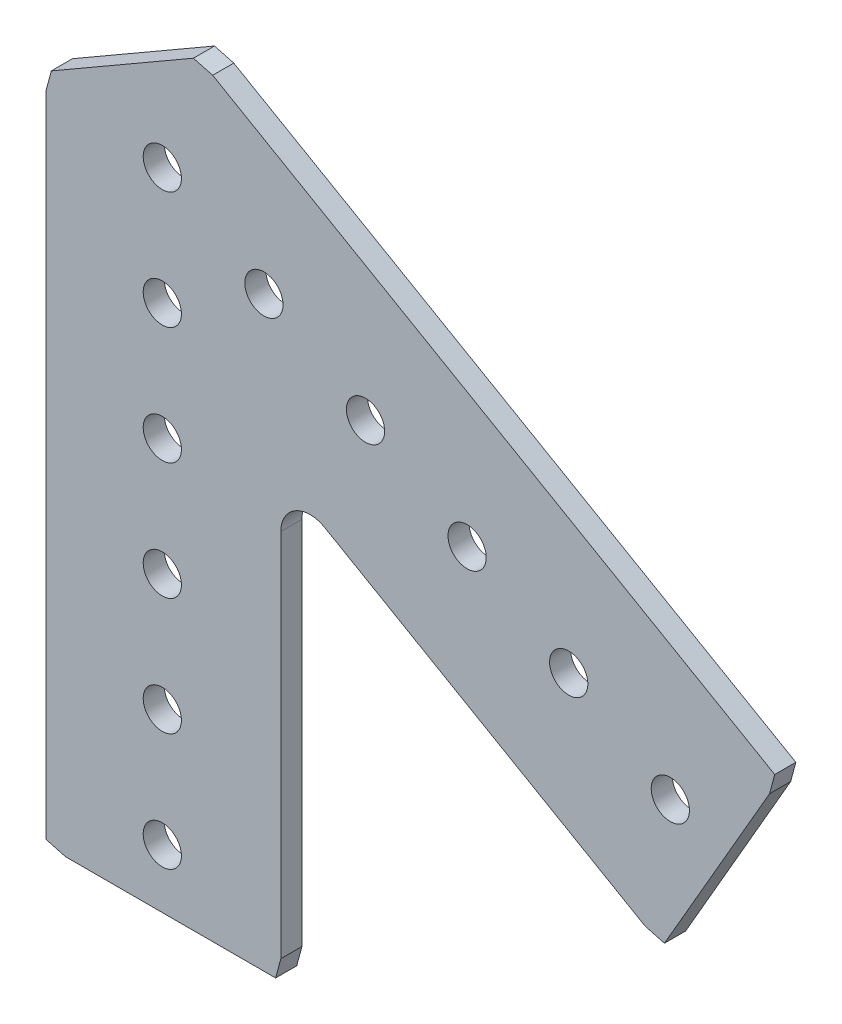
ISO-10303-21;
HEADER;
FILE_DESCRIPTION(('STEP AP214'),'2;1');
FILE_NAME('part.step','',(''),(''),'','','');
FILE_SCHEMA(('AUTOMOTIVE_DESIGN { 1 0 10303 214 1 1 1 1 }'));
ENDSEC;
DATA;
#1=APPLICATION_CONTEXT('core data for automotive mechanical design processes');
#2=APPLICATION_PROTOCOL_DEFINITION('international standard','automotive_design',2000,#1);
#3=PRODUCT_CONTEXT('',#1,'mechanical');
#4=PRODUCT('Part','Part','',(#3));
#5=PRODUCT_RELATED_PRODUCT_CATEGORY('part','',(#4));
#6=PRODUCT_DEFINITION_FORMATION('','',#4);
#7=PRODUCT_DEFINITION_CONTEXT('part definition',#1,'design');
#8=PRODUCT_DEFINITION('design','',#6,#7);
#9=PRODUCT_DEFINITION_SHAPE('','',#8);
#10=(LENGTH_UNIT() NAMED_UNIT(*) SI_UNIT(.MILLI.,.METRE.));
#11=(NAMED_UNIT(*) PLANE_ANGLE_UNIT() SI_UNIT($,.RADIAN.));
#12=(NAMED_UNIT(*) SI_UNIT($,.STERADIAN.) SOLID_ANGLE_UNIT());
#13=UNCERTAINTY_MEASURE_WITH_UNIT(LENGTH_MEASURE(1.E-05),#10,'distance_accuracy_value','');
#14=(GEOMETRIC_REPRESENTATION_CONTEXT(3) GLOBAL_UNCERTAINTY_ASSIGNED_CONTEXT((#13)) GLOBAL_UNIT_ASSIGNED_CONTEXT((#10,
#11,#12)) REPRESENTATION_CONTEXT('',''));
#15=CARTESIAN_POINT('',(0.,0.,0.));
#16=DIRECTION('',(0.,0.,1.));
#17=DIRECTION('',(1.,0.,0.));
#18=AXIS2_PLACEMENT_3D('',#15,#16,#17);
#19=CARTESIAN_POINT('',(16.002,-27.7162770227176,0.));
#20=DIRECTION('',(0.,0.,1.));
#21=DIRECTION('',(1.,0.,0.));
#22=AXIS2_PLACEMENT_3D('',#19,#20,#21);
#23=CYLINDRICAL_SURFACE('',#22,3.175);
#24=CARTESIAN_POINT('',(16.002,-27.7162770227176,2.286));
#25=DIRECTION('',(0.,0.,-1.));
#26=DIRECTION('',(-1.,0.,0.));
#27=AXIS2_PLACEMENT_3D('',#24,#25,#26);
#28=CIRCLE('',#27,3.175);
#29=CARTESIAN_POINT('',(12.827,-27.7162770227176,2.286));
#30=VERTEX_POINT('',#29);
#31=CARTESIAN_POINT('',(17.5895,-24.966646365702,2.286));
#32=VERTEX_POINT('',#31);
#33=EDGE_CURVE('E166',#30,#32,#28,.T.);
#34=ORIENTED_EDGE('',*,*,#33,.F.);
#35=DIRECTION('',(0.,0.,1.));
#36=VECTOR('',#35,1.);
#37=CARTESIAN_POINT('',(12.827,-27.7162770227176,0.));
#38=LINE('',#37,#36);
#39=CARTESIAN_POINT('',(12.827,-27.7162770227176,0.));
#40=VERTEX_POINT('',#39);
#41=EDGE_CURVE('E11',#40,#30,#38,.T.);
#42=ORIENTED_EDGE('',*,*,#41,.F.);
#43=CARTESIAN_POINT('',(16.002,-27.7162770227176,0.));
#44=DIRECTION('',(0.,0.,-1.));
#45=DIRECTION('',(-1.,0.,0.));
#46=AXIS2_PLACEMENT_3D('',#43,#44,#45);
#47=CIRCLE('',#46,3.175);
#48=CARTESIAN_POINT('',(17.5895,-24.966646365702,0.));
#49=VERTEX_POINT('',#48);
#50=EDGE_CURVE('E205',#40,#49,#47,.T.);
#51=ORIENTED_EDGE('',*,*,#50,.T.);
#52=DIRECTION('',(0.,0.,1.));
#53=VECTOR('',#52,1.);
#54=CARTESIAN_POINT('',(17.5895,-24.966646365702,0.));
#55=LINE('',#54,#53);
#56=EDGE_CURVE('E36',#49,#32,#55,.T.);
#57=ORIENTED_EDGE('',*,*,#56,.T.);
#58=EDGE_LOOP('',(#34,#42,#51,#57));
#59=FACE_BOUND('',#58,.T.);
#60=ADVANCED_FACE('F33',(#59),#23,.F.);
#61=CARTESIAN_POINT('',(12.827,-67.7645661410419,0.));
#62=DIRECTION('',(1.,0.,0.));
#63=DIRECTION('',(0.,1.,0.));
#64=AXIS2_PLACEMENT_3D('',#61,#62,#63);
#65=PLANE('',#64);
#66=DIRECTION('',(0.,1.,0.));
#67=VECTOR('',#66,1.);
#68=CARTESIAN_POINT('',(12.827,-67.7645661410419,2.286));
#69=LINE('',#68,#67);
#70=CARTESIAN_POINT('',(12.827,-67.7645661410419,2.286));
#71=VERTEX_POINT('',#70);
#72=EDGE_CURVE('E203',#71,#30,#69,.T.);
#73=ORIENTED_EDGE('',*,*,#72,.F.);
#74=DIRECTION('',(0.,0.,1.));
#75=VECTOR('',#74,1.);
#76=CARTESIAN_POINT('',(12.827,-67.7645661410419,0.));
#77=LINE('',#76,#75);
#78=CARTESIAN_POINT('',(12.827,-67.7645661410419,0.));
#79=VERTEX_POINT('',#78);
#80=EDGE_CURVE('E42',#79,#71,#77,.T.);
#81=ORIENTED_EDGE('',*,*,#80,.F.);
#82=DIRECTION('',(0.,1.,0.));
#83=VECTOR('',#82,1.);
#84=CARTESIAN_POINT('',(12.827,-67.7645661410419,0.));
#85=LINE('',#84,#83);
#86=EDGE_CURVE('E156',#79,#40,#85,.T.);
#87=ORIENTED_EDGE('',*,*,#86,.T.);
#88=ORIENTED_EDGE('',*,*,#41,.T.);
#89=EDGE_LOOP('',(#73,#81,#87,#88));
#90=FACE_BOUND('',#89,.T.);
#91=ADVANCED_FACE('F229',(#90),#65,.T.);
#92=CARTESIAN_POINT('',(12.2682096816237,-69.85,0.));
#93=DIRECTION('',(0.96592582628907,-0.258819045102513,0.));
#94=DIRECTION('',(0.258819045102513,0.96592582628907,0.));
#95=AXIS2_PLACEMENT_3D('',#92,#93,#94);
#96=PLANE('',#95);
#97=DIRECTION('',(0.258819045102513,0.96592582628907,0.));
#98=VECTOR('',#97,1.);
#99=CARTESIAN_POINT('',(12.2682096816237,-69.85,2.286));
#100=LINE('',#99,#98);
#101=CARTESIAN_POINT('',(12.2682096816237,-69.85,2.286));
#102=VERTEX_POINT('',#101);
#103=EDGE_CURVE('E143',#102,#71,#100,.T.);
#104=ORIENTED_EDGE('',*,*,#103,.F.);
#105=DIRECTION('',(0.,0.,1.));
#106=VECTOR('',#105,1.);
#107=CARTESIAN_POINT('',(12.2682096816237,-69.85,0.));
#108=LINE('',#107,#106);
#109=CARTESIAN_POINT('',(12.2682096816237,-69.85,0.));
#110=VERTEX_POINT('',#109);
#111=EDGE_CURVE('E138',#110,#102,#108,.T.);
#112=ORIENTED_EDGE('',*,*,#111,.F.);
#113=DIRECTION('',(0.258819045102513,0.96592582628907,0.));
#114=VECTOR('',#113,1.);
#115=CARTESIAN_POINT('',(12.2682096816237,-69.85,0.));
#116=LINE('',#115,#114);
#117=EDGE_CURVE('E141',#110,#79,#116,.T.);
#118=ORIENTED_EDGE('',*,*,#117,.T.);
#119=ORIENTED_EDGE('',*,*,#80,.T.);
#120=EDGE_LOOP('',(#104,#112,#118,#119));
#121=FACE_BOUND('',#120,.T.);
#122=ADVANCED_FACE('F140',(#121),#96,.T.);
#123=CARTESIAN_POINT('',(-10.4875661410418,-69.85,0.));
#124=DIRECTION('',(0.,-1.,0.));
#125=DIRECTION('',(1.,0.,0.));
#126=AXIS2_PLACEMENT_3D('',#123,#124,#125);
#127=PLANE('',#126);
#128=DIRECTION('',(1.,0.,0.));
#129=VECTOR('',#128,1.);
#130=CARTESIAN_POINT('',(-10.4875661410418,-69.85,2.286));
#131=LINE('',#130,#129);
#132=CARTESIAN_POINT('',(-10.4875661410418,-69.85,2.286));
#133=VERTEX_POINT('',#132);
#134=EDGE_CURVE('E200',#133,#102,#131,.T.);
#135=ORIENTED_EDGE('',*,*,#134,.F.);
#136=DIRECTION('',(0.,0.,1.));
#137=VECTOR('',#136,1.);
#138=CARTESIAN_POINT('',(-10.4875661410418,-69.85,0.));
#139=LINE('',#138,#137);
#140=CARTESIAN_POINT('',(-10.4875661410418,-69.85,0.));
#141=VERTEX_POINT('',#140);
#142=EDGE_CURVE('E148',#141,#133,#139,.T.);
#143=ORIENTED_EDGE('',*,*,#142,.F.);
#144=DIRECTION('',(1.,0.,0.));
#145=VECTOR('',#144,1.);
#146=CARTESIAN_POINT('',(-10.4875661410418,-69.85,0.));
#147=LINE('',#146,#145);
#148=EDGE_CURVE('E154',#141,#110,#147,.T.);
#149=ORIENTED_EDGE('',*,*,#148,.T.);
#150=ORIENTED_EDGE('',*,*,#111,.T.);
#151=EDGE_LOOP('',(#135,#143,#149,#150));
#152=FACE_BOUND('',#151,.T.);
#153=ADVANCED_FACE('F158',(#152),#127,.T.);
#154=CARTESIAN_POINT('',(-12.573,-69.2912096816237,0.));
#155=DIRECTION('',(-0.258819045102507,-0.965925826289072,0.));
#156=DIRECTION('',(0.965925826289072,-0.258819045102507,0.));
#157=AXIS2_PLACEMENT_3D('',#154,#155,#156);
#158=PLANE('',#157);
#159=DIRECTION('',(0.965925826289072,-0.258819045102507,0.));
#160=VECTOR('',#159,1.);
#161=CARTESIAN_POINT('',(-12.573,-69.2912096816237,2.286));
#162=LINE('',#161,#160);
#163=CARTESIAN_POINT('',(-12.573,-69.2912096816237,2.286));
#164=VERTEX_POINT('',#163);
#165=EDGE_CURVE('E197',#164,#133,#162,.T.);
#166=ORIENTED_EDGE('',*,*,#165,.F.);
#167=DIRECTION('',(0.,0.,1.));
#168=VECTOR('',#167,1.);
#169=CARTESIAN_POINT('',(-12.573,-69.2912096816237,0.));
#170=LINE('',#169,#168);
#171=CARTESIAN_POINT('',(-12.573,-69.2912096816237,0.));
#172=VERTEX_POINT('',#171);
#173=EDGE_CURVE('E209',#172,#164,#170,.T.);
#174=ORIENTED_EDGE('',*,*,#173,.F.);
#175=DIRECTION('',(0.965925826289072,-0.258819045102507,0.));
#176=VECTOR('',#175,1.);
#177=CARTESIAN_POINT('',(-12.573,-69.2912096816237,0.));
#178=LINE('',#177,#176);
#179=EDGE_CURVE('E159',#172,#141,#178,.T.);
#180=ORIENTED_EDGE('',*,*,#179,.T.);
#181=ORIENTED_EDGE('',*,*,#142,.T.);
#182=EDGE_LOOP('',(#166,#174,#180,#181));
#183=FACE_BOUND('',#182,.T.);
#184=ADVANCED_FACE('F242',(#183),#158,.T.);
#185=CARTESIAN_POINT('',(-12.573,0.964258685340516,0.));
#186=DIRECTION('',(-1.,0.,0.));
#187=DIRECTION('',(0.,-1.,0.));
#188=AXIS2_PLACEMENT_3D('',#185,#186,#187);
#189=PLANE('',#188);
#190=DIRECTION('',(0.,-1.,0.));
#191=VECTOR('',#190,1.);
#192=CARTESIAN_POINT('',(-12.573,0.964258685340516,2.286));
#193=LINE('',#192,#191);
#194=CARTESIAN_POINT('',(-12.573,0.964258685340516,2.286));
#195=VERTEX_POINT('',#194);
#196=EDGE_CURVE('E194',#195,#164,#193,.T.);
#197=ORIENTED_EDGE('',*,*,#196,.F.);
#198=DIRECTION('',(0.,0.,1.));
#199=VECTOR('',#198,1.);
#200=CARTESIAN_POINT('',(-12.573,0.964258685340516,0.));
#201=LINE('',#200,#199);
#202=CARTESIAN_POINT('',(-12.573,0.964258685340516,0.));
#203=VERTEX_POINT('',#202);
#204=EDGE_CURVE('E211',#203,#195,#201,.T.);
#205=ORIENTED_EDGE('',*,*,#204,.F.);
#206=DIRECTION('',(0.,-1.,0.));
#207=VECTOR('',#206,1.);
#208=CARTESIAN_POINT('',(-12.573,0.964258685340516,0.));
#209=LINE('',#208,#207);
#210=EDGE_CURVE('E161',#203,#172,#209,.T.);
#211=ORIENTED_EDGE('',*,*,#210,.T.);
#212=ORIENTED_EDGE('',*,*,#173,.T.);
#213=EDGE_LOOP('',(#197,#205,#211,#212));
#214=FACE_BOUND('',#213,.T.);
#215=ADVANCED_FACE('F245',(#214),#189,.T.);
#216=CARTESIAN_POINT('',(-12.0142096816237,3.04969254429867,0.));
#217=DIRECTION('',(-0.96592582628907,0.258819045102514,0.));
#218=DIRECTION('',(-0.258819045102514,-0.96592582628907,0.));
#219=AXIS2_PLACEMENT_3D('',#216,#217,#218);
#220=PLANE('',#219);
#221=DIRECTION('',(-0.258819045102514,-0.96592582628907,0.));
#222=VECTOR('',#221,1.);
#223=CARTESIAN_POINT('',(-12.0142096816237,3.04969254429867,2.286));
#224=LINE('',#223,#222);
#225=CARTESIAN_POINT('',(-12.0142096816237,3.04969254429867,2.286));
#226=VERTEX_POINT('',#225);
#227=EDGE_CURVE('E191',#226,#195,#224,.T.);
#228=ORIENTED_EDGE('',*,*,#227,.F.);
#229=DIRECTION('',(0.,0.,1.));
#230=VECTOR('',#229,1.);
#231=CARTESIAN_POINT('',(-12.0142096816237,3.04969254429867,0.));
#232=LINE('',#231,#230);
#233=CARTESIAN_POINT('',(-12.0142096816237,3.04969254429867,0.));
#234=VERTEX_POINT('',#233);
#235=EDGE_CURVE('E213',#234,#226,#232,.T.);
#236=ORIENTED_EDGE('',*,*,#235,.F.);
#237=DIRECTION('',(-0.258819045102514,-0.96592582628907,0.));
#238=VECTOR('',#237,1.);
#239=CARTESIAN_POINT('',(-12.0142096816237,3.04969254429867,0.));
#240=LINE('',#239,#238);
#241=EDGE_CURVE('E423',#234,#203,#240,.T.);
#242=ORIENTED_EDGE('',*,*,#241,.T.);
#243=ORIENTED_EDGE('',*,*,#204,.T.);
#244=EDGE_LOOP('',(#228,#236,#242,#243));
#245=FACE_BOUND('',#244,.T.);
#246=ADVANCED_FACE('F249',(#245),#220,.T.);
#247=CARTESIAN_POINT('',(3.36599362371686,11.9294570628281,0.));
#248=DIRECTION('',(-0.499999999999998,0.86602540378444,0.));
#249=DIRECTION('',(-0.86602540378444,-0.499999999999998,0.));
#250=AXIS2_PLACEMENT_3D('',#247,#248,#249);
#251=PLANE('',#250);
#252=DIRECTION('',(-0.86602540378444,-0.499999999999998,0.));
#253=VECTOR('',#252,1.);
#254=CARTESIAN_POINT('',(3.36599362371686,11.9294570628281,2.286));
#255=LINE('',#254,#253);
#256=CARTESIAN_POINT('',(3.36599362371686,11.9294570628281,2.286));
#257=VERTEX_POINT('',#256);
#258=EDGE_CURVE('E188',#257,#226,#255,.T.);
#259=ORIENTED_EDGE('',*,*,#258,.F.);
#260=DIRECTION('',(0.,0.,1.));
#261=VECTOR('',#260,1.);
#262=CARTESIAN_POINT('',(3.36599362371686,11.9294570628281,0.));
#263=LINE('',#262,#261);
#264=CARTESIAN_POINT('',(3.36599362371686,11.9294570628281,0.));
#265=VERTEX_POINT('',#264);
#266=EDGE_CURVE('E215',#265,#257,#263,.T.);
#267=ORIENTED_EDGE('',*,*,#266,.F.);
#268=DIRECTION('',(-0.86602540378444,-0.499999999999998,0.));
#269=VECTOR('',#268,1.);
#270=CARTESIAN_POINT('',(3.36599362371686,11.9294570628281,0.));
#271=LINE('',#270,#269);
#272=EDGE_CURVE('E420',#265,#234,#271,.T.);
#273=ORIENTED_EDGE('',*,*,#272,.T.);
#274=ORIENTED_EDGE('',*,*,#235,.T.);
#275=EDGE_LOOP('',(#259,#267,#273,#274));
#276=FACE_BOUND('',#275,.T.);
#277=ADVANCED_FACE('F253',(#276),#251,.T.);
#278=CARTESIAN_POINT('',(5.45142748267629,11.3706667444515,0.));
#279=DIRECTION('',(0.258819045102516,0.965925826289069,0.));
#280=DIRECTION('',(-0.96592582628907,0.258819045102516,0.));
#281=AXIS2_PLACEMENT_3D('',#278,#279,#280);
#282=PLANE('',#281);
#283=DIRECTION('',(-0.965925826289069,0.258819045102516,0.));
#284=VECTOR('',#283,1.);
#285=CARTESIAN_POINT('',(5.45142748267629,11.3706667444515,2.286));
#286=LINE('',#285,#284);
#287=CARTESIAN_POINT('',(5.45142748267629,11.3706667444515,2.286));
#288=VERTEX_POINT('',#287);
#289=EDGE_CURVE('E185',#288,#257,#286,.T.);
#290=ORIENTED_EDGE('',*,*,#289,.F.);
#291=DIRECTION('',(0.,0.,1.));
#292=VECTOR('',#291,1.);
#293=CARTESIAN_POINT('',(5.45142748267629,11.3706667444515,0.));
#294=LINE('',#293,#292);
#295=CARTESIAN_POINT('',(5.45142748267629,11.3706667444515,0.));
#296=VERTEX_POINT('',#295);
#297=EDGE_CURVE('E217',#296,#288,#294,.T.);
#298=ORIENTED_EDGE('',*,*,#297,.F.);
#299=DIRECTION('',(-0.965925826289069,0.258819045102516,0.));
#300=VECTOR('',#299,1.);
#301=CARTESIAN_POINT('',(5.45142748267629,11.3706667444515,0.));
#302=LINE('',#301,#300);
#303=EDGE_CURVE('E417',#296,#265,#302,.T.);
#304=ORIENTED_EDGE('',*,*,#303,.T.);
#305=ORIENTED_EDGE('',*,*,#266,.T.);
#306=EDGE_LOOP('',(#290,#298,#304,#305));
#307=FACE_BOUND('',#306,.T.);
#308=ADVANCED_FACE('F257',(#307),#282,.T.);
#309=CARTESIAN_POINT('',(66.2944478432401,-23.7570674390303,0.));
#310=DIRECTION('',(0.500000000000004,0.866025403784436,0.));
#311=DIRECTION('',(-0.866025403784436,0.500000000000004,0.));
#312=AXIS2_PLACEMENT_3D('',#309,#310,#311);
#313=PLANE('',#312);
#314=DIRECTION('',(-0.866025403784436,0.500000000000004,0.));
#315=VECTOR('',#314,1.);
#316=CARTESIAN_POINT('',(66.2944478432401,-23.7570674390303,2.286));
#317=LINE('',#316,#315);
#318=CARTESIAN_POINT('',(66.2944478432401,-23.7570674390303,2.286));
#319=VERTEX_POINT('',#318);
#320=EDGE_CURVE('E182',#319,#288,#317,.T.);
#321=ORIENTED_EDGE('',*,*,#320,.F.);
#322=DIRECTION('',(0.,0.,1.));
#323=VECTOR('',#322,1.);
#324=CARTESIAN_POINT('',(66.2944478432401,-23.7570674390303,0.));
#325=LINE('',#324,#323);
#326=CARTESIAN_POINT('',(66.2944478432401,-23.7570674390303,0.));
#327=VERTEX_POINT('',#326);
#328=EDGE_CURVE('E219',#327,#319,#325,.T.);
#329=ORIENTED_EDGE('',*,*,#328,.F.);
#330=DIRECTION('',(-0.866025403784436,0.500000000000004,0.));
#331=VECTOR('',#330,1.);
#332=CARTESIAN_POINT('',(66.2944478432401,-23.7570674390303,0.));
#333=LINE('',#332,#331);
#334=EDGE_CURVE('E414',#327,#296,#333,.T.);
#335=ORIENTED_EDGE('',*,*,#334,.T.);
#336=ORIENTED_EDGE('',*,*,#297,.T.);
#337=EDGE_LOOP('',(#321,#329,#335,#336));
#338=FACE_BOUND('',#337,.T.);
#339=ADVANCED_FACE('F261',(#338),#313,.T.);
#340=CARTESIAN_POINT('',(65.7356575248637,-25.8425012979888,0.));
#341=DIRECTION('',(0.965925826289071,-0.258819045102511,0.));
#342=DIRECTION('',(0.258819045102511,0.965925826289071,0.));
#343=AXIS2_PLACEMENT_3D('',#340,#341,#342);
#344=PLANE('',#343);
#345=DIRECTION('',(0.258819045102511,0.965925826289071,0.));
#346=VECTOR('',#345,1.);
#347=CARTESIAN_POINT('',(65.7356575248637,-25.8425012979888,2.286));
#348=LINE('',#347,#346);
#349=CARTESIAN_POINT('',(65.7356575248637,-25.8425012979888,2.286));
#350=VERTEX_POINT('',#349);
#351=EDGE_CURVE('E179',#350,#319,#348,.T.);
#352=ORIENTED_EDGE('',*,*,#351,.F.);
#353=DIRECTION('',(0.,0.,1.));
#354=VECTOR('',#353,1.);
#355=CARTESIAN_POINT('',(65.7356575248637,-25.8425012979888,0.));
#356=LINE('',#355,#354);
#357=CARTESIAN_POINT('',(65.7356575248637,-25.8425012979888,0.));
#358=VERTEX_POINT('',#357);
#359=EDGE_CURVE('E221',#358,#350,#356,.T.);
#360=ORIENTED_EDGE('',*,*,#359,.F.);
#361=DIRECTION('',(0.258819045102511,0.965925826289071,0.));
#362=VECTOR('',#361,1.);
#363=CARTESIAN_POINT('',(65.7356575248637,-25.8425012979888,0.));
#364=LINE('',#363,#362);
#365=EDGE_CURVE('E411',#358,#327,#364,.T.);
#366=ORIENTED_EDGE('',*,*,#365,.T.);
#367=ORIENTED_EDGE('',*,*,#328,.T.);
#368=EDGE_LOOP('',(#352,#360,#366,#367));
#369=FACE_BOUND('',#368,.T.);
#370=ADVANCED_FACE('F265',(#369),#344,.T.);
#371=CARTESIAN_POINT('',(54.357769613531,-45.5495812432405,0.));
#372=DIRECTION('',(0.866025403784436,-0.500000000000004,0.));
#373=DIRECTION('',(0.500000000000004,0.866025403784436,0.));
#374=AXIS2_PLACEMENT_3D('',#371,#372,#373);
#375=PLANE('',#374);
#376=DIRECTION('',(0.500000000000004,0.866025403784436,0.));
#377=VECTOR('',#376,1.);
#378=CARTESIAN_POINT('',(54.357769613531,-45.5495812432405,2.286));
#379=LINE('',#378,#377);
#380=CARTESIAN_POINT('',(54.357769613531,-45.5495812432405,2.286));
#381=VERTEX_POINT('',#380);
#382=EDGE_CURVE('E176',#381,#350,#379,.T.);
#383=ORIENTED_EDGE('',*,*,#382,.F.);
#384=DIRECTION('',(0.,0.,1.));
#385=VECTOR('',#384,1.);
#386=CARTESIAN_POINT('',(54.357769613531,-45.5495812432405,0.));
#387=LINE('',#386,#385);
#388=CARTESIAN_POINT('',(54.357769613531,-45.5495812432405,0.));
#389=VERTEX_POINT('',#388);
#390=EDGE_CURVE('E223',#389,#381,#387,.T.);
#391=ORIENTED_EDGE('',*,*,#390,.F.);
#392=DIRECTION('',(0.500000000000004,0.866025403784436,0.));
#393=VECTOR('',#392,1.);
#394=CARTESIAN_POINT('',(54.357769613531,-45.5495812432405,0.));
#395=LINE('',#394,#393);
#396=EDGE_CURVE('E408',#389,#358,#395,.T.);
#397=ORIENTED_EDGE('',*,*,#396,.T.);
#398=ORIENTED_EDGE('',*,*,#359,.T.);
#399=EDGE_LOOP('',(#383,#391,#397,#398));
#400=FACE_BOUND('',#399,.T.);
#401=ADVANCED_FACE('F269',(#400),#375,.T.);
#402=CARTESIAN_POINT('',(52.2723357545729,-44.9907909248642,0.));
#403=DIRECTION('',(-0.258819045102518,-0.965925826289069,0.));
#404=DIRECTION('',(0.965925826289069,-0.258819045102518,0.));
#405=AXIS2_PLACEMENT_3D('',#402,#403,#404);
#406=PLANE('',#405);
#407=DIRECTION('',(0.965925826289069,-0.258819045102518,0.));
#408=VECTOR('',#407,1.);
#409=CARTESIAN_POINT('',(52.2723357545729,-44.9907909248642,2.286));
#410=LINE('',#409,#408);
#411=CARTESIAN_POINT('',(52.2723357545729,-44.9907909248642,2.286));
#412=VERTEX_POINT('',#411);
#413=EDGE_CURVE('E173',#412,#381,#410,.T.);
#414=ORIENTED_EDGE('',*,*,#413,.F.);
#415=DIRECTION('',(0.,0.,1.));
#416=VECTOR('',#415,1.);
#417=CARTESIAN_POINT('',(52.2723357545729,-44.9907909248642,0.));
#418=LINE('',#417,#416);
#419=CARTESIAN_POINT('',(52.2723357545729,-44.9907909248642,0.));
#420=VERTEX_POINT('',#419);
#421=EDGE_CURVE('E224',#420,#412,#418,.T.);
#422=ORIENTED_EDGE('',*,*,#421,.F.);
#423=DIRECTION('',(0.965925826289069,-0.258819045102518,0.));
#424=VECTOR('',#423,1.);
#425=CARTESIAN_POINT('',(52.2723357545729,-44.9907909248642,0.));
#426=LINE('',#425,#424);
#427=EDGE_CURVE('E405',#420,#389,#426,.T.);
#428=ORIENTED_EDGE('',*,*,#427,.T.);
#429=ORIENTED_EDGE('',*,*,#390,.T.);
#430=EDGE_LOOP('',(#414,#422,#428,#429));
#431=FACE_BOUND('',#430,.T.);
#432=ADVANCED_FACE('F273',(#431),#406,.T.);
#433=CARTESIAN_POINT('',(17.5895,-24.966646365702,0.));
#434=DIRECTION('',(-0.5,-0.866025403784439,0.));
#435=DIRECTION('',(0.866025403784439,-0.5,0.));
#436=AXIS2_PLACEMENT_3D('',#433,#434,#435);
#437=PLANE('',#436);
#438=DIRECTION('',(0.866025403784439,-0.5,0.));
#439=VECTOR('',#438,1.);
#440=CARTESIAN_POINT('',(17.5895,-24.966646365702,2.286));
#441=LINE('',#440,#439);
#442=EDGE_CURVE('E169',#32,#412,#441,.T.);
#443=ORIENTED_EDGE('',*,*,#442,.F.);
#444=ORIENTED_EDGE('',*,*,#56,.F.);
#445=DIRECTION('',(0.866025403784439,-0.5,0.));
#446=VECTOR('',#445,1.);
#447=CARTESIAN_POINT('',(17.5895,-24.966646365702,0.));
#448=LINE('',#447,#446);
#449=EDGE_CURVE('E403',#49,#420,#448,.T.);
#450=ORIENTED_EDGE('',*,*,#449,.T.);
#451=ORIENTED_EDGE('',*,*,#421,.T.);
#452=EDGE_LOOP('',(#443,#444,#450,#451));
#453=FACE_BOUND('',#452,.T.);
#454=ADVANCED_FACE('F226',(#453),#437,.T.);
#455=CARTESIAN_POINT('',(16.002,-27.7162770227176,0.));
#456=DIRECTION('',(0.,0.,-1.));
#457=DIRECTION('',(-1.,0.,0.));
#458=AXIS2_PLACEMENT_3D('',#455,#456,#457);
#459=PLANE('',#458);
#460=CARTESIAN_POINT('',(0.,-63.5,0.));
#461=DIRECTION('',(0.,0.,1.));
#462=DIRECTION('',(-1.,0.,0.));
#463=AXIS2_PLACEMENT_3D('',#460,#461,#462);
#464=CIRCLE('',#463,2.0701);
#465=CARTESIAN_POINT('',(-2.07009999999999,-63.5,0.));
#466=VERTEX_POINT('',#465);
#467=EDGE_CURVE('E336',#466,#466,#464,.T.);
#468=ORIENTED_EDGE('',*,*,#467,.T.);
#469=EDGE_LOOP('',(#468));
#470=FACE_BOUND('',#469,.T.);
#471=CARTESIAN_POINT('',(43.9940905122498,-25.3999999999994,0.));
#472=DIRECTION('',(0.,0.,1.));
#473=DIRECTION('',(-1.,0.,0.));
#474=AXIS2_PLACEMENT_3D('',#471,#472,#473);
#475=CIRCLE('',#474,2.0701);
#476=CARTESIAN_POINT('',(41.9239905122498,-25.3999999999994,0.));
#477=VERTEX_POINT('',#476);
#478=EDGE_CURVE('E344',#477,#477,#475,.T.);
#479=ORIENTED_EDGE('',*,*,#478,.T.);
#480=EDGE_LOOP('',(#479));
#481=FACE_BOUND('',#480,.T.);
#482=CARTESIAN_POINT('',(21.9970452561249,-12.6999999999997,0.));
#483=DIRECTION('',(0.,0.,1.));
#484=DIRECTION('',(-1.,0.,0.));
#485=AXIS2_PLACEMENT_3D('',#482,#483,#484);
#486=CIRCLE('',#485,2.0701);
#487=CARTESIAN_POINT('',(19.9269452561249,-12.6999999999997,0.));
#488=VERTEX_POINT('',#487);
#489=EDGE_CURVE('E350',#488,#488,#486,.T.);
#490=ORIENTED_EDGE('',*,*,#489,.T.);
#491=EDGE_LOOP('',(#490));
#492=FACE_BOUND('',#491,.T.);
#493=CARTESIAN_POINT('',(3.9907631702977E-13,-38.1,0.));
#494=DIRECTION('',(0.,0.,1.));
#495=DIRECTION('',(-1.,0.,0.));
#496=AXIS2_PLACEMENT_3D('',#493,#494,#495);
#497=CIRCLE('',#496,2.0701);
#498=CARTESIAN_POINT('',(-2.0700999999996,-38.1,0.));
#499=VERTEX_POINT('',#498);
#500=EDGE_CURVE('E356',#499,#499,#497,.T.);
#501=ORIENTED_EDGE('',*,*,#500,.T.);
#502=EDGE_LOOP('',(#501));
#503=FACE_BOUND('',#502,.T.);
#504=CARTESIAN_POINT('',(1.33025439009923E-13,-12.7,0.));
#505=DIRECTION('',(0.,0.,1.));
#506=DIRECTION('',(-1.,0.,0.));
#507=AXIS2_PLACEMENT_3D('',#504,#505,#506);
#508=CIRCLE('',#507,2.0701);
#509=CARTESIAN_POINT('',(-2.07009999999987,-12.7,0.));
#510=VERTEX_POINT('',#509);
#511=EDGE_CURVE('E362',#510,#510,#508,.T.);
#512=ORIENTED_EDGE('',*,*,#511,.T.);
#513=EDGE_LOOP('',(#512));
#514=FACE_BOUND('',#513,.T.);
#515=CARTESIAN_POINT('',(0.,0.,0.));
#516=DIRECTION('',(0.,0.,1.));
#517=DIRECTION('',(-1.,0.,0.));
#518=AXIS2_PLACEMENT_3D('',#515,#516,#517);
#519=CIRCLE('',#518,2.0701);
#520=CARTESIAN_POINT('',(-2.0701,0.,0.));
#521=VERTEX_POINT('',#520);
#522=EDGE_CURVE('E368',#521,#521,#519,.T.);
#523=ORIENTED_EDGE('',*,*,#522,.T.);
#524=EDGE_LOOP('',(#523));
#525=FACE_BOUND('',#524,.T.);
#526=CARTESIAN_POINT('',(10.9985226280625,-6.34999999999986,0.));
#527=DIRECTION('',(0.,0.,1.));
#528=DIRECTION('',(-1.,0.,0.));
#529=AXIS2_PLACEMENT_3D('',#526,#527,#528);
#530=CIRCLE('',#529,2.0701);
#531=CARTESIAN_POINT('',(8.92842262806245,-6.34999999999986,0.));
#532=VERTEX_POINT('',#531);
#533=EDGE_CURVE('E374',#532,#532,#530,.T.);
#534=ORIENTED_EDGE('',*,*,#533,.T.);
#535=EDGE_LOOP('',(#534));
#536=FACE_BOUND('',#535,.T.);
#537=CARTESIAN_POINT('',(2.66050878019847E-13,-25.4,0.));
#538=DIRECTION('',(0.,0.,1.));
#539=DIRECTION('',(-1.,0.,0.));
#540=AXIS2_PLACEMENT_3D('',#537,#538,#539);
#541=CIRCLE('',#540,2.0701);
#542=CARTESIAN_POINT('',(-2.07009999999973,-25.4,0.));
#543=VERTEX_POINT('',#542);
#544=EDGE_CURVE('E380',#543,#543,#541,.T.);
#545=ORIENTED_EDGE('',*,*,#544,.T.);
#546=EDGE_LOOP('',(#545));
#547=FACE_BOUND('',#546,.T.);
#548=CARTESIAN_POINT('',(0.,-50.8,0.));
#549=DIRECTION('',(0.,0.,1.));
#550=DIRECTION('',(-1.,0.,0.));
#551=AXIS2_PLACEMENT_3D('',#548,#549,#550);
#552=CIRCLE('',#551,2.0701);
#553=CARTESIAN_POINT('',(-2.07009999999999,-50.8,0.));
#554=VERTEX_POINT('',#553);
#555=EDGE_CURVE('E386',#554,#554,#552,.T.);
#556=ORIENTED_EDGE('',*,*,#555,.T.);
#557=EDGE_LOOP('',(#556));
#558=FACE_BOUND('',#557,.T.);
#559=CARTESIAN_POINT('',(32.9955678841874,-19.0499999999996,0.));
#560=DIRECTION('',(0.,0.,1.));
#561=DIRECTION('',(-1.,0.,0.));
#562=AXIS2_PLACEMENT_3D('',#559,#560,#561);
#563=CIRCLE('',#562,2.0701);
#564=CARTESIAN_POINT('',(30.9254678841874,-19.0499999999996,0.));
#565=VERTEX_POINT('',#564);
#566=EDGE_CURVE('E392',#565,#565,#563,.T.);
#567=ORIENTED_EDGE('',*,*,#566,.T.);
#568=EDGE_LOOP('',(#567));
#569=FACE_BOUND('',#568,.T.);
#570=CARTESIAN_POINT('',(54.9926131403117,-31.7500000000003,0.));
#571=DIRECTION('',(0.,0.,1.));
#572=DIRECTION('',(-1.,0.,0.));
#573=AXIS2_PLACEMENT_3D('',#570,#571,#572);
#574=CIRCLE('',#573,2.0701);
#575=CARTESIAN_POINT('',(52.9225131403117,-31.7500000000003,0.));
#576=VERTEX_POINT('',#575);
#577=EDGE_CURVE('E170',#576,#576,#574,.T.);
#578=ORIENTED_EDGE('',*,*,#577,.T.);
#579=EDGE_LOOP('',(#578));
#580=FACE_BOUND('',#579,.T.);
#581=ORIENTED_EDGE('',*,*,#50,.F.);
#582=ORIENTED_EDGE('',*,*,#86,.F.);
#583=ORIENTED_EDGE('',*,*,#117,.F.);
#584=ORIENTED_EDGE('',*,*,#148,.F.);
#585=ORIENTED_EDGE('',*,*,#179,.F.);
#586=ORIENTED_EDGE('',*,*,#210,.F.);
#587=ORIENTED_EDGE('',*,*,#241,.F.);
#588=ORIENTED_EDGE('',*,*,#272,.F.);
#589=ORIENTED_EDGE('',*,*,#303,.F.);
#590=ORIENTED_EDGE('',*,*,#334,.F.);
#591=ORIENTED_EDGE('',*,*,#365,.F.);
#592=ORIENTED_EDGE('',*,*,#396,.F.);
#593=ORIENTED_EDGE('',*,*,#427,.F.);
#594=ORIENTED_EDGE('',*,*,#449,.F.);
#595=EDGE_LOOP('',(#581,#582,#583,#584,#585,#586,#587,#588,#589,#590,#591,#592,#593,#594));
#596=FACE_BOUND('',#595,.T.);
#597=ADVANCED_FACE('F152',(#470,#481,#492,#503,#514,#525,#536,#547,#558,#569,#580,#596),#459,.T.);
#598=CARTESIAN_POINT('',(16.002,-27.7162770227176,2.286));
#599=DIRECTION('',(0.,0.,-1.));
#600=DIRECTION('',(-1.,0.,0.));
#601=AXIS2_PLACEMENT_3D('',#598,#599,#600);
#602=PLANE('',#601);
#603=CARTESIAN_POINT('',(0.,-63.5,2.286));
#604=DIRECTION('',(0.,0.,1.));
#605=DIRECTION('',(-1.,0.,0.));
#606=AXIS2_PLACEMENT_3D('',#603,#604,#605);
#607=CIRCLE('',#606,2.0701);
#608=CARTESIAN_POINT('',(-2.07009999999999,-63.5,2.286));
#609=VERTEX_POINT('',#608);
#610=EDGE_CURVE('E339',#609,#609,#607,.T.);
#611=ORIENTED_EDGE('',*,*,#610,.F.);
#612=EDGE_LOOP('',(#611));
#613=FACE_BOUND('',#612,.T.);
#614=CARTESIAN_POINT('',(43.9940905122498,-25.3999999999994,2.286));
#615=DIRECTION('',(0.,0.,1.));
#616=DIRECTION('',(-1.,0.,0.));
#617=AXIS2_PLACEMENT_3D('',#614,#615,#616);
#618=CIRCLE('',#617,2.0701);
#619=CARTESIAN_POINT('',(41.9239905122498,-25.3999999999994,2.286));
#620=VERTEX_POINT('',#619);
#621=EDGE_CURVE('E341',#620,#620,#618,.T.);
#622=ORIENTED_EDGE('',*,*,#621,.F.);
#623=EDGE_LOOP('',(#622));
#624=FACE_BOUND('',#623,.T.);
#625=CARTESIAN_POINT('',(21.9970452561249,-12.6999999999997,2.286));
#626=DIRECTION('',(0.,0.,1.));
#627=DIRECTION('',(-1.,0.,0.));
#628=AXIS2_PLACEMENT_3D('',#625,#626,#627);
#629=CIRCLE('',#628,2.0701);
#630=CARTESIAN_POINT('',(19.9269452561249,-12.6999999999997,2.286));
#631=VERTEX_POINT('',#630);
#632=EDGE_CURVE('E347',#631,#631,#629,.T.);
#633=ORIENTED_EDGE('',*,*,#632,.F.);
#634=EDGE_LOOP('',(#633));
#635=FACE_BOUND('',#634,.T.);
#636=CARTESIAN_POINT('',(3.9907631702977E-13,-38.1,2.286));
#637=DIRECTION('',(0.,0.,1.));
#638=DIRECTION('',(-1.,0.,0.));
#639=AXIS2_PLACEMENT_3D('',#636,#637,#638);
#640=CIRCLE('',#639,2.0701);
#641=CARTESIAN_POINT('',(-2.0700999999996,-38.1,2.286));
#642=VERTEX_POINT('',#641);
#643=EDGE_CURVE('E353',#642,#642,#640,.T.);
#644=ORIENTED_EDGE('',*,*,#643,.F.);
#645=EDGE_LOOP('',(#644));
#646=FACE_BOUND('',#645,.T.);
#647=CARTESIAN_POINT('',(1.33025439009923E-13,-12.7,2.286));
#648=DIRECTION('',(0.,0.,1.));
#649=DIRECTION('',(-1.,0.,0.));
#650=AXIS2_PLACEMENT_3D('',#647,#648,#649);
#651=CIRCLE('',#650,2.0701);
#652=CARTESIAN_POINT('',(-2.07009999999987,-12.7,2.286));
#653=VERTEX_POINT('',#652);
#654=EDGE_CURVE('E359',#653,#653,#651,.T.);
#655=ORIENTED_EDGE('',*,*,#654,.F.);
#656=EDGE_LOOP('',(#655));
#657=FACE_BOUND('',#656,.T.);
#658=CARTESIAN_POINT('',(0.,0.,2.286));
#659=DIRECTION('',(0.,0.,1.));
#660=DIRECTION('',(-1.,0.,0.));
#661=AXIS2_PLACEMENT_3D('',#658,#659,#660);
#662=CIRCLE('',#661,2.0701);
#663=CARTESIAN_POINT('',(-2.0701,0.,2.286));
#664=VERTEX_POINT('',#663);
#665=EDGE_CURVE('E365',#664,#664,#662,.T.);
#666=ORIENTED_EDGE('',*,*,#665,.F.);
#667=EDGE_LOOP('',(#666));
#668=FACE_BOUND('',#667,.T.);
#669=CARTESIAN_POINT('',(10.9985226280625,-6.34999999999986,2.286));
#670=DIRECTION('',(0.,0.,1.));
#671=DIRECTION('',(-1.,0.,0.));
#672=AXIS2_PLACEMENT_3D('',#669,#670,#671);
#673=CIRCLE('',#672,2.0701);
#674=CARTESIAN_POINT('',(8.92842262806245,-6.34999999999986,2.286));
#675=VERTEX_POINT('',#674);
#676=EDGE_CURVE('E371',#675,#675,#673,.T.);
#677=ORIENTED_EDGE('',*,*,#676,.F.);
#678=EDGE_LOOP('',(#677));
#679=FACE_BOUND('',#678,.T.);
#680=CARTESIAN_POINT('',(2.66050878019847E-13,-25.4,2.286));
#681=DIRECTION('',(0.,0.,1.));
#682=DIRECTION('',(-1.,0.,0.));
#683=AXIS2_PLACEMENT_3D('',#680,#681,#682);
#684=CIRCLE('',#683,2.0701);
#685=CARTESIAN_POINT('',(-2.07009999999973,-25.4,2.286));
#686=VERTEX_POINT('',#685);
#687=EDGE_CURVE('E377',#686,#686,#684,.T.);
#688=ORIENTED_EDGE('',*,*,#687,.F.);
#689=EDGE_LOOP('',(#688));
#690=FACE_BOUND('',#689,.T.);
#691=CARTESIAN_POINT('',(0.,-50.8,2.286));
#692=DIRECTION('',(0.,0.,1.));
#693=DIRECTION('',(-1.,0.,0.));
#694=AXIS2_PLACEMENT_3D('',#691,#692,#693);
#695=CIRCLE('',#694,2.0701);
#696=CARTESIAN_POINT('',(-2.07009999999999,-50.8,2.286));
#697=VERTEX_POINT('',#696);
#698=EDGE_CURVE('E383',#697,#697,#695,.T.);
#699=ORIENTED_EDGE('',*,*,#698,.F.);
#700=EDGE_LOOP('',(#699));
#701=FACE_BOUND('',#700,.T.);
#702=CARTESIAN_POINT('',(32.9955678841874,-19.0499999999996,2.286));
#703=DIRECTION('',(0.,0.,1.));
#704=DIRECTION('',(-1.,0.,0.));
#705=AXIS2_PLACEMENT_3D('',#702,#703,#704);
#706=CIRCLE('',#705,2.0701);
#707=CARTESIAN_POINT('',(30.9254678841874,-19.0499999999996,2.286));
#708=VERTEX_POINT('',#707);
#709=EDGE_CURVE('E389',#708,#708,#706,.T.);
#710=ORIENTED_EDGE('',*,*,#709,.F.);
#711=EDGE_LOOP('',(#710));
#712=FACE_BOUND('',#711,.T.);
#713=CARTESIAN_POINT('',(54.9926131403117,-31.7500000000003,2.286));
#714=DIRECTION('',(0.,0.,1.));
#715=DIRECTION('',(-1.,0.,0.));
#716=AXIS2_PLACEMENT_3D('',#713,#714,#715);
#717=CIRCLE('',#716,2.0701);
#718=CARTESIAN_POINT('',(52.9225131403117,-31.7500000000003,2.286));
#719=VERTEX_POINT('',#718);
#720=EDGE_CURVE('E395',#719,#719,#717,.T.);
#721=ORIENTED_EDGE('',*,*,#720,.F.);
#722=EDGE_LOOP('',(#721));
#723=FACE_BOUND('',#722,.T.);
#724=ORIENTED_EDGE('',*,*,#33,.T.);
#725=ORIENTED_EDGE('',*,*,#442,.T.);
#726=ORIENTED_EDGE('',*,*,#413,.T.);
#727=ORIENTED_EDGE('',*,*,#382,.T.);
#728=ORIENTED_EDGE('',*,*,#351,.T.);
#729=ORIENTED_EDGE('',*,*,#320,.T.);
#730=ORIENTED_EDGE('',*,*,#289,.T.);
#731=ORIENTED_EDGE('',*,*,#258,.T.);
#732=ORIENTED_EDGE('',*,*,#227,.T.);
#733=ORIENTED_EDGE('',*,*,#196,.T.);
#734=ORIENTED_EDGE('',*,*,#165,.T.);
#735=ORIENTED_EDGE('',*,*,#134,.T.);
#736=ORIENTED_EDGE('',*,*,#103,.T.);
#737=ORIENTED_EDGE('',*,*,#72,.T.);
#738=EDGE_LOOP('',(#724,#725,#726,#727,#728,#729,#730,#731,#732,#733,#734,#735,#736,#737));
#739=FACE_BOUND('',#738,.T.);
#740=ADVANCED_FACE('F228',(#613,#624,#635,#646,#657,#668,#679,#690,#701,#712,#723,#739),#602,.F.);
#741=CARTESIAN_POINT('',(54.9926131403117,-31.7500000000003,0.));
#742=DIRECTION('',(0.,0.,1.));
#743=DIRECTION('',(1.,0.,0.));
#744=AXIS2_PLACEMENT_3D('',#741,#742,#743);
#745=CYLINDRICAL_SURFACE('',#744,2.0701);
#746=ORIENTED_EDGE('',*,*,#577,.F.);
#747=EDGE_LOOP('',(#746));
#748=FACE_BOUND('',#747,.T.);
#749=ORIENTED_EDGE('',*,*,#720,.T.);
#750=EDGE_LOOP('',(#749));
#751=FACE_BOUND('',#750,.T.);
#752=ADVANCED_FACE('F285',(#748,#751),#745,.F.);
#753=CARTESIAN_POINT('',(32.9955678841874,-19.0499999999996,0.));
#754=DIRECTION('',(0.,0.,1.));
#755=DIRECTION('',(1.,0.,0.));
#756=AXIS2_PLACEMENT_3D('',#753,#754,#755);
#757=CYLINDRICAL_SURFACE('',#756,2.0701);
#758=ORIENTED_EDGE('',*,*,#566,.F.);
#759=EDGE_LOOP('',(#758));
#760=FACE_BOUND('',#759,.T.);
#761=ORIENTED_EDGE('',*,*,#709,.T.);
#762=EDGE_LOOP('',(#761));
#763=FACE_BOUND('',#762,.T.);
#764=ADVANCED_FACE('F292',(#760,#763),#757,.F.);
#765=CARTESIAN_POINT('',(0.,-50.8,0.));
#766=DIRECTION('',(0.,0.,1.));
#767=DIRECTION('',(1.,0.,0.));
#768=AXIS2_PLACEMENT_3D('',#765,#766,#767);
#769=CYLINDRICAL_SURFACE('',#768,2.0701);
#770=ORIENTED_EDGE('',*,*,#555,.F.);
#771=EDGE_LOOP('',(#770));
#772=FACE_BOUND('',#771,.T.);
#773=ORIENTED_EDGE('',*,*,#698,.T.);
#774=EDGE_LOOP('',(#773));
#775=FACE_BOUND('',#774,.T.);
#776=ADVANCED_FACE('F296',(#772,#775),#769,.F.);
#777=CARTESIAN_POINT('',(2.66050878019847E-13,-25.4,0.));
#778=DIRECTION('',(0.,0.,1.));
#779=DIRECTION('',(1.,0.,0.));
#780=AXIS2_PLACEMENT_3D('',#777,#778,#779);
#781=CYLINDRICAL_SURFACE('',#780,2.0701);
#782=ORIENTED_EDGE('',*,*,#544,.F.);
#783=EDGE_LOOP('',(#782));
#784=FACE_BOUND('',#783,.T.);
#785=ORIENTED_EDGE('',*,*,#687,.T.);
#786=EDGE_LOOP('',(#785));
#787=FACE_BOUND('',#786,.T.);
#788=ADVANCED_FACE('F300',(#784,#787),#781,.F.);
#789=CARTESIAN_POINT('',(10.9985226280625,-6.34999999999986,0.));
#790=DIRECTION('',(0.,0.,1.));
#791=DIRECTION('',(1.,0.,0.));
#792=AXIS2_PLACEMENT_3D('',#789,#790,#791);
#793=CYLINDRICAL_SURFACE('',#792,2.0701);
#794=ORIENTED_EDGE('',*,*,#533,.F.);
#795=EDGE_LOOP('',(#794));
#796=FACE_BOUND('',#795,.T.);
#797=ORIENTED_EDGE('',*,*,#676,.T.);
#798=EDGE_LOOP('',(#797));
#799=FACE_BOUND('',#798,.T.);
#800=ADVANCED_FACE('F304',(#796,#799),#793,.F.);
#801=CARTESIAN_POINT('',(0.,0.,0.));
#802=DIRECTION('',(0.,0.,1.));
#803=DIRECTION('',(1.,0.,0.));
#804=AXIS2_PLACEMENT_3D('',#801,#802,#803);
#805=CYLINDRICAL_SURFACE('',#804,2.0701);
#806=ORIENTED_EDGE('',*,*,#522,.F.);
#807=EDGE_LOOP('',(#806));
#808=FACE_BOUND('',#807,.T.);
#809=ORIENTED_EDGE('',*,*,#665,.T.);
#810=EDGE_LOOP('',(#809));
#811=FACE_BOUND('',#810,.T.);
#812=ADVANCED_FACE('F308',(#808,#811),#805,.F.);
#813=CARTESIAN_POINT('',(1.33025439009923E-13,-12.7,0.));
#814=DIRECTION('',(0.,0.,1.));
#815=DIRECTION('',(1.,0.,0.));
#816=AXIS2_PLACEMENT_3D('',#813,#814,#815);
#817=CYLINDRICAL_SURFACE('',#816,2.0701);
#818=ORIENTED_EDGE('',*,*,#511,.F.);
#819=EDGE_LOOP('',(#818));
#820=FACE_BOUND('',#819,.T.);
#821=ORIENTED_EDGE('',*,*,#654,.T.);
#822=EDGE_LOOP('',(#821));
#823=FACE_BOUND('',#822,.T.);
#824=ADVANCED_FACE('F312',(#820,#823),#817,.F.);
#825=CARTESIAN_POINT('',(3.9907631702977E-13,-38.1,0.));
#826=DIRECTION('',(0.,0.,1.));
#827=DIRECTION('',(1.,0.,0.));
#828=AXIS2_PLACEMENT_3D('',#825,#826,#827);
#829=CYLINDRICAL_SURFACE('',#828,2.0701);
#830=ORIENTED_EDGE('',*,*,#500,.F.);
#831=EDGE_LOOP('',(#830));
#832=FACE_BOUND('',#831,.T.);
#833=ORIENTED_EDGE('',*,*,#643,.T.);
#834=EDGE_LOOP('',(#833));
#835=FACE_BOUND('',#834,.T.);
#836=ADVANCED_FACE('F316',(#832,#835),#829,.F.);
#837=CARTESIAN_POINT('',(21.9970452561249,-12.6999999999997,0.));
#838=DIRECTION('',(0.,0.,1.));
#839=DIRECTION('',(1.,0.,0.));
#840=AXIS2_PLACEMENT_3D('',#837,#838,#839);
#841=CYLINDRICAL_SURFACE('',#840,2.0701);
#842=ORIENTED_EDGE('',*,*,#489,.F.);
#843=EDGE_LOOP('',(#842));
#844=FACE_BOUND('',#843,.T.);
#845=ORIENTED_EDGE('',*,*,#632,.T.);
#846=EDGE_LOOP('',(#845));
#847=FACE_BOUND('',#846,.T.);
#848=ADVANCED_FACE('F320',(#844,#847),#841,.F.);
#849=CARTESIAN_POINT('',(43.9940905122498,-25.3999999999994,0.));
#850=DIRECTION('',(0.,0.,1.));
#851=DIRECTION('',(1.,0.,0.));
#852=AXIS2_PLACEMENT_3D('',#849,#850,#851);
#853=CYLINDRICAL_SURFACE('',#852,2.0701);
#854=ORIENTED_EDGE('',*,*,#478,.F.);
#855=EDGE_LOOP('',(#854));
#856=FACE_BOUND('',#855,.T.);
#857=ORIENTED_EDGE('',*,*,#621,.T.);
#858=EDGE_LOOP('',(#857));
#859=FACE_BOUND('',#858,.T.);
#860=ADVANCED_FACE('F324',(#856,#859),#853,.F.);
#861=CARTESIAN_POINT('',(0.,-63.5,0.));
#862=DIRECTION('',(0.,0.,1.));
#863=DIRECTION('',(1.,0.,0.));
#864=AXIS2_PLACEMENT_3D('',#861,#862,#863);
#865=CYLINDRICAL_SURFACE('',#864,2.0701);
#866=ORIENTED_EDGE('',*,*,#467,.F.);
#867=EDGE_LOOP('',(#866));
#868=FACE_BOUND('',#867,.T.);
#869=ORIENTED_EDGE('',*,*,#610,.T.);
#870=EDGE_LOOP('',(#869));
#871=FACE_BOUND('',#870,.T.);
#872=ADVANCED_FACE('F328',(#868,#871),#865,.F.);
#873=CLOSED_SHELL('',(#60,#91,#122,#153,#184,#215,#246,#277,#308,#339,#370,#401,#432,#454,#597,
#740,#752,#764,#776,#788,#800,#812,#824,#836,#848,#860,#872));
#874=MANIFOLD_SOLID_BREP('B2',#873);
#875=ADVANCED_BREP_SHAPE_REPRESENTATION('',(#18,#874),#14);
#876=SHAPE_DEFINITION_REPRESENTATION(#9,#875);
ENDSEC;
END-ISO-10303-21;
